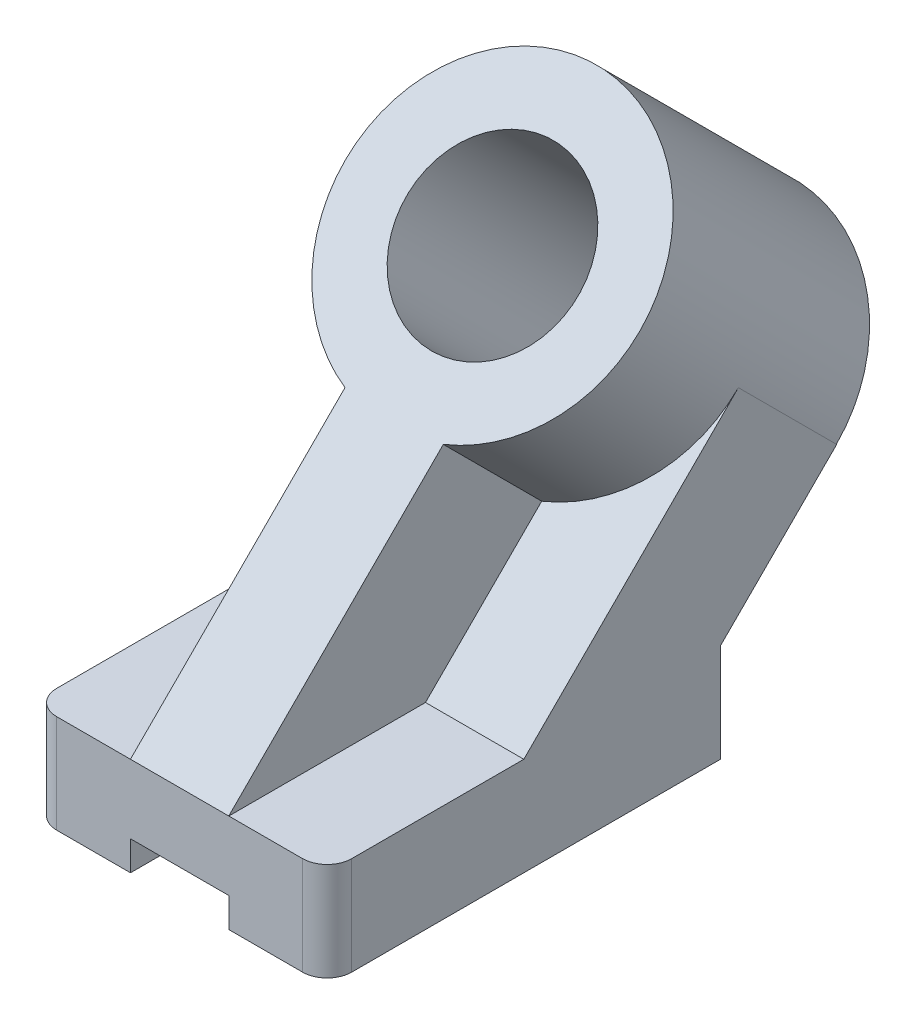
ISO-10303-21;
HEADER;
FILE_DESCRIPTION(('STEP AP214'),'2;1');
FILE_NAME('part.step','',(''),(''),'','','');
FILE_SCHEMA(('AUTOMOTIVE_DESIGN { 1 0 10303 214 1 1 1 1 }'));
ENDSEC;
DATA;
#1=APPLICATION_CONTEXT('core data for automotive mechanical design processes');
#2=APPLICATION_PROTOCOL_DEFINITION('international standard','automotive_design',2000,#1);
#3=PRODUCT_CONTEXT('',#1,'mechanical');
#4=PRODUCT('Part','Part','',(#3));
#5=PRODUCT_RELATED_PRODUCT_CATEGORY('part','',(#4));
#6=PRODUCT_DEFINITION_FORMATION('','',#4);
#7=PRODUCT_DEFINITION_CONTEXT('part definition',#1,'design');
#8=PRODUCT_DEFINITION('design','',#6,#7);
#9=PRODUCT_DEFINITION_SHAPE('','',#8);
#10=(LENGTH_UNIT() NAMED_UNIT(*) SI_UNIT(.MILLI.,.METRE.));
#11=(NAMED_UNIT(*) PLANE_ANGLE_UNIT() SI_UNIT($,.RADIAN.));
#12=(NAMED_UNIT(*) SI_UNIT($,.STERADIAN.) SOLID_ANGLE_UNIT());
#13=UNCERTAINTY_MEASURE_WITH_UNIT(LENGTH_MEASURE(1.E-05),#10,'distance_accuracy_value','');
#14=(GEOMETRIC_REPRESENTATION_CONTEXT(3) GLOBAL_UNCERTAINTY_ASSIGNED_CONTEXT((#13)) GLOBAL_UNIT_ASSIGNED_CONTEXT((#10,
#11,#12)) REPRESENTATION_CONTEXT('',''));
#15=CARTESIAN_POINT('',(0.,0.,0.));
#16=DIRECTION('',(0.,0.,1.));
#17=DIRECTION('',(1.,0.,0.));
#18=AXIS2_PLACEMENT_3D('',#15,#16,#17);
#19=CARTESIAN_POINT('',(-47.008273381295,-23.7097122302158,-101.6));
#20=DIRECTION('',(0.,-1.,0.));
#21=DIRECTION('',(0.,0.,-1.));
#22=AXIS2_PLACEMENT_3D('',#19,#20,#21);
#23=PLANE('',#22);
#24=DIRECTION('',(0.,0.,-1.));
#25=VECTOR('',#24,1.);
#26=CARTESIAN_POINT('',(-21.608273381295,-23.7097122302158,-101.6));
#27=LINE('',#26,#25);
#28=CARTESIAN_POINT('',(-21.608273381295,-23.7097122302158,0.));
#29=VERTEX_POINT('',#28);
#30=CARTESIAN_POINT('',(-21.608273381295,-23.7097122302158,-101.6));
#31=VERTEX_POINT('',#30);
#32=EDGE_CURVE('E307',#29,#31,#27,.T.);
#33=ORIENTED_EDGE('',*,*,#32,.F.);
#34=DIRECTION('',(1.,0.,0.));
#35=VECTOR('',#34,1.);
#36=CARTESIAN_POINT('',(-47.008273381295,-23.7097122302158,0.));
#37=LINE('',#36,#35);
#38=CARTESIAN_POINT('',(-40.658273381295,-23.7097122302158,0.));
#39=VERTEX_POINT('',#38);
#40=EDGE_CURVE('E365',#39,#29,#37,.T.);
#41=ORIENTED_EDGE('',*,*,#40,.F.);
#42=CARTESIAN_POINT('',(-40.658273381295,-23.7097122302158,-6.35));
#43=DIRECTION('',(0.,-1.,0.));
#44=DIRECTION('',(0.,0.,-1.));
#45=AXIS2_PLACEMENT_3D('',#42,#43,#44);
#46=CIRCLE('',#45,6.35);
#47=CARTESIAN_POINT('',(-47.008273381295,-23.7097122302158,-6.35));
#48=VERTEX_POINT('',#47);
#49=EDGE_CURVE('E247',#48,#39,#46,.F.);
#50=ORIENTED_EDGE('',*,*,#49,.F.);
#51=DIRECTION('',(0.,0.,1.));
#52=VECTOR('',#51,1.);
#53=CARTESIAN_POINT('',(-47.008273381295,-23.7097122302158,-101.6));
#54=LINE('',#53,#52);
#55=CARTESIAN_POINT('',(-47.008273381295,-23.7097122302158,-101.6));
#56=VERTEX_POINT('',#55);
#57=EDGE_CURVE('E364',#56,#48,#54,.T.);
#58=ORIENTED_EDGE('',*,*,#57,.F.);
#59=DIRECTION('',(1.,0.,0.));
#60=VECTOR('',#59,1.);
#61=CARTESIAN_POINT('',(-47.008273381295,-23.7097122302158,-101.6));
#62=LINE('',#61,#60);
#63=EDGE_CURVE('E353',#56,#31,#62,.T.);
#64=ORIENTED_EDGE('',*,*,#63,.T.);
#65=EDGE_LOOP('',(#33,#41,#50,#58,#64));
#66=FACE_BOUND('',#65,.T.);
#67=ADVANCED_FACE('F51',(#66),#23,.T.);
#68=CARTESIAN_POINT('',(29.191726618705,1.69028776978418,-101.6));
#69=DIRECTION('',(1.,0.,0.));
#70=DIRECTION('',(0.,0.,-1.));
#71=AXIS2_PLACEMENT_3D('',#68,#69,#70);
#72=PLANE('',#71);
#73=DIRECTION('',(0.,0.,1.));
#74=VECTOR('',#73,1.);
#75=CARTESIAN_POINT('',(29.191726618705,1.69028776978418,-101.6));
#76=LINE('',#75,#74);
#77=CARTESIAN_POINT('',(29.191726618705,1.69028776978418,-50.8));
#78=VERTEX_POINT('',#77);
#79=CARTESIAN_POINT('',(29.191726618705,1.69028776978418,-6.35));
#80=VERTEX_POINT('',#79);
#81=EDGE_CURVE('E377',#78,#80,#76,.T.);
#82=ORIENTED_EDGE('',*,*,#81,.T.);
#83=DIRECTION('',(0.,1.,0.));
#84=VECTOR('',#83,1.);
#85=CARTESIAN_POINT('',(29.191726618705,-49.0340344916305,-6.35));
#86=LINE('',#85,#84);
#87=CARTESIAN_POINT('',(29.191726618705,-23.7097122302158,-6.35));
#88=VERTEX_POINT('',#87);
#89=EDGE_CURVE('E236',#88,#80,#86,.T.);
#90=ORIENTED_EDGE('',*,*,#89,.F.);
#91=DIRECTION('',(0.,0.,1.));
#92=VECTOR('',#91,1.);
#93=CARTESIAN_POINT('',(29.191726618705,-23.7097122302158,-101.6));
#94=LINE('',#93,#92);
#95=CARTESIAN_POINT('',(29.191726618705,-23.7097122302158,-101.6));
#96=VERTEX_POINT('',#95);
#97=EDGE_CURVE('E381',#96,#88,#94,.T.);
#98=ORIENTED_EDGE('',*,*,#97,.F.);
#99=DIRECTION('',(0.,1.,0.));
#100=VECTOR('',#99,1.);
#101=CARTESIAN_POINT('',(29.191726618705,1.69028776978418,-101.6));
#102=LINE('',#101,#100);
#103=CARTESIAN_POINT('',(29.191726618705,1.69028776978418,-101.6));
#104=VERTEX_POINT('',#103);
#105=EDGE_CURVE('E357',#96,#104,#102,.T.);
#106=ORIENTED_EDGE('',*,*,#105,.T.);
#107=DIRECTION('',(0.,0.707106781186556,-0.707106781186539));
#108=VECTOR('',#107,1.);
#109=CARTESIAN_POINT('',(29.191726618705,1.69028776978418,-101.6));
#110=LINE('',#109,#108);
#111=CARTESIAN_POINT('',(29.191726618705,31.7125928594075,-131.622305089623));
#112=VERTEX_POINT('',#111);
#113=EDGE_CURVE('E310',#104,#112,#110,.T.);
#114=ORIENTED_EDGE('',*,*,#113,.T.);
#115=DIRECTION('',(0.,0.707106781186539,0.707106781186556));
#116=VECTOR('',#115,1.);
#117=CARTESIAN_POINT('',(29.191726618705,31.7125928594075,-131.622305089623));
#118=LINE('',#117,#116);
#119=CARTESIAN_POINT('',(29.191726618705,31.7882705979928,-131.546627351037));
#120=VERTEX_POINT('',#119);
#121=EDGE_CURVE('E330',#112,#120,#118,.T.);
#122=ORIENTED_EDGE('',*,*,#121,.T.);
#123=CARTESIAN_POINT('',(29.191726618705,57.1125928594075,-106.222305089622));
#124=VERTEX_POINT('',#123);
#125=EDGE_CURVE('E329',#120,#124,#118,.T.);
#126=ORIENTED_EDGE('',*,*,#125,.T.);
#127=DIRECTION('',(0.,-0.707106781186556,0.707106781186539));
#128=VECTOR('',#127,1.);
#129=CARTESIAN_POINT('',(29.191726618705,1.69028776978418,-50.8));
#130=LINE('',#129,#128);
#131=EDGE_CURVE('E316',#124,#78,#130,.T.);
#132=ORIENTED_EDGE('',*,*,#131,.T.);
#133=EDGE_LOOP('',(#82,#90,#98,#106,#114,#122,#126,#132));
#134=FACE_BOUND('',#133,.T.);
#135=ADVANCED_FACE('F544',(#134),#72,.T.);
#136=CARTESIAN_POINT('',(0.,0.,0.));
#137=DIRECTION('',(0.,0.,1.));
#138=DIRECTION('',(1.,0.,0.));
#139=AXIS2_PLACEMENT_3D('',#136,#137,#138);
#140=PLANE('',#139);
#141=DIRECTION('',(0.,-1.,0.));
#142=VECTOR('',#141,1.);
#143=CARTESIAN_POINT('',(-21.608273381295,-23.7097122302158,0.));
#144=LINE('',#143,#142);
#145=CARTESIAN_POINT('',(-21.608273381295,-16.0897122302158,0.));
#146=VERTEX_POINT('',#145);
#147=EDGE_CURVE('E204',#146,#29,#144,.T.);
#148=ORIENTED_EDGE('',*,*,#147,.F.);
#149=DIRECTION('',(-1.,0.,0.));
#150=VECTOR('',#149,1.);
#151=CARTESIAN_POINT('',(-21.608273381295,-16.0897122302158,0.));
#152=LINE('',#151,#150);
#153=CARTESIAN_POINT('',(3.79172661870501,-16.0897122302158,0.));
#154=VERTEX_POINT('',#153);
#155=EDGE_CURVE('E199',#154,#146,#152,.T.);
#156=ORIENTED_EDGE('',*,*,#155,.F.);
#157=DIRECTION('',(0.,1.,0.));
#158=VECTOR('',#157,1.);
#159=CARTESIAN_POINT('',(3.79172661870501,-23.7097122302158,0.));
#160=LINE('',#159,#158);
#161=CARTESIAN_POINT('',(3.79172661870501,-23.7097122302158,0.));
#162=VERTEX_POINT('',#161);
#163=EDGE_CURVE('E207',#162,#154,#160,.T.);
#164=ORIENTED_EDGE('',*,*,#163,.F.);
#165=CARTESIAN_POINT('',(22.841726618705,-23.7097122302158,0.));
#166=VERTEX_POINT('',#165);
#167=EDGE_CURVE('E341',#162,#166,#37,.T.);
#168=ORIENTED_EDGE('',*,*,#167,.T.);
#169=DIRECTION('',(0.,1.,0.));
#170=VECTOR('',#169,1.);
#171=CARTESIAN_POINT('',(22.841726618705,-49.0340344916305,0.));
#172=LINE('',#171,#170);
#173=CARTESIAN_POINT('',(22.841726618705,1.69028776978418,0.));
#174=VERTEX_POINT('',#173);
#175=EDGE_CURVE('E402',#174,#166,#172,.F.);
#176=ORIENTED_EDGE('',*,*,#175,.F.);
#177=DIRECTION('',(-1.,0.,0.));
#178=VECTOR('',#177,1.);
#179=CARTESIAN_POINT('',(-47.008273381295,1.69028776978418,0.));
#180=LINE('',#179,#178);
#181=CARTESIAN_POINT('',(3.79172661870501,1.69028776978419,0.));
#182=VERTEX_POINT('',#181);
#183=EDGE_CURVE('E352',#174,#182,#180,.T.);
#184=ORIENTED_EDGE('',*,*,#183,.T.);
#185=CARTESIAN_POINT('',(-21.608273381295,1.69028776978419,0.));
#186=VERTEX_POINT('',#185);
#187=EDGE_CURVE('E371',#182,#186,#180,.T.);
#188=ORIENTED_EDGE('',*,*,#187,.T.);
#189=CARTESIAN_POINT('',(-40.658273381295,1.69028776978418,0.));
#190=VERTEX_POINT('',#189);
#191=EDGE_CURVE('E368',#186,#190,#180,.T.);
#192=ORIENTED_EDGE('',*,*,#191,.T.);
#193=DIRECTION('',(0.,1.,0.));
#194=VECTOR('',#193,1.);
#195=CARTESIAN_POINT('',(-40.658273381295,-49.0340344916305,0.));
#196=LINE('',#195,#194);
#197=EDGE_CURVE('E60',#190,#39,#196,.F.);
#198=ORIENTED_EDGE('',*,*,#197,.T.);
#199=ORIENTED_EDGE('',*,*,#40,.T.);
#200=EDGE_LOOP('',(#148,#156,#164,#168,#176,#184,#188,#192,#198,#199));
#201=FACE_BOUND('',#200,.T.);
#202=ADVANCED_FACE('F214',(#201),#140,.T.);
#203=CARTESIAN_POINT('',(-47.008273381295,31.7125928594075,-131.622305089623));
#204=DIRECTION('',(0.,0.707106781186556,-0.707106781186539));
#205=DIRECTION('',(0.,0.707106781186539,0.707106781186556));
#206=AXIS2_PLACEMENT_3D('',#203,#204,#205);
#207=PLANE('',#206);
#208=DIRECTION('',(0.,0.707106781186539,0.707106781186556));
#209=VECTOR('',#208,1.);
#210=CARTESIAN_POINT('',(-31.133273381295,-22.0932661284215,-185.428164077453));
#211=LINE('',#210,#209);
#212=CARTESIAN_POINT('',(-31.133273381295,31.7125928594076,-131.622305089623));
#213=VERTEX_POINT('',#212);
#214=CARTESIAN_POINT('',(-31.133273381295,31.7882705979928,-131.546627351037));
#215=VERTEX_POINT('',#214);
#216=EDGE_CURVE('E257',#213,#215,#211,.T.);
#217=ORIENTED_EDGE('',*,*,#216,.F.);
#218=DIRECTION('',(1.,0.,0.));
#219=VECTOR('',#218,1.);
#220=CARTESIAN_POINT('',(-47.008273381295,31.7125928594075,-131.622305089623));
#221=LINE('',#220,#219);
#222=CARTESIAN_POINT('',(-47.008273381295,31.7125928594075,-131.622305089623));
#223=VERTEX_POINT('',#222);
#224=EDGE_CURVE('E343',#223,#213,#221,.T.);
#225=ORIENTED_EDGE('',*,*,#224,.F.);
#226=DIRECTION('',(0.,0.707106781186539,0.707106781186556));
#227=VECTOR('',#226,1.);
#228=CARTESIAN_POINT('',(-47.008273381295,31.7125928594075,-131.622305089623));
#229=LINE('',#228,#227);
#230=CARTESIAN_POINT('',(-47.008273381295,31.7882705979928,-131.546627351037));
#231=VERTEX_POINT('',#230);
#232=EDGE_CURVE('E317',#223,#231,#229,.T.);
#233=ORIENTED_EDGE('',*,*,#232,.T.);
#234=DIRECTION('',(1.,0.,0.));
#235=VECTOR('',#234,1.);
#236=CARTESIAN_POINT('',(-47.008273381295,31.7882705979928,-131.546627351037));
#237=LINE('',#236,#235);
#238=EDGE_CURVE('E388',#231,#215,#237,.T.);
#239=ORIENTED_EDGE('',*,*,#238,.T.);
#240=EDGE_LOOP('',(#217,#225,#233,#239));
#241=FACE_BOUND('',#240,.T.);
#242=ADVANCED_FACE('F568',(#241),#207,.T.);
#243=CARTESIAN_POINT('',(-47.008273381295,1.69028776978418,-101.6));
#244=DIRECTION('',(0.,1.,0.));
#245=DIRECTION('',(0.,0.,1.));
#246=AXIS2_PLACEMENT_3D('',#243,#244,#245);
#247=PLANE('',#246);
#248=CARTESIAN_POINT('',(-40.658273381295,1.69028776978418,-6.35));
#249=DIRECTION('',(0.,-1.,0.));
#250=DIRECTION('',(0.,0.,1.));
#251=AXIS2_PLACEMENT_3D('',#248,#249,#250);
#252=CIRCLE('',#251,6.35);
#253=CARTESIAN_POINT('',(-47.008273381295,1.69028776978418,-6.35));
#254=VERTEX_POINT('',#253);
#255=EDGE_CURVE('E232',#190,#254,#252,.T.);
#256=ORIENTED_EDGE('',*,*,#255,.F.);
#257=ORIENTED_EDGE('',*,*,#191,.F.);
#258=DIRECTION('',(0.,0.,1.));
#259=VECTOR('',#258,1.);
#260=CARTESIAN_POINT('',(-21.608273381295,1.69028776978418,-101.6));
#261=LINE('',#260,#259);
#262=CARTESIAN_POINT('',(-21.608273381295,1.69028776978418,-50.8));
#263=VERTEX_POINT('',#262);
#264=EDGE_CURVE('E304',#263,#186,#261,.T.);
#265=ORIENTED_EDGE('',*,*,#264,.F.);
#266=DIRECTION('',(1.,0.,0.));
#267=VECTOR('',#266,1.);
#268=CARTESIAN_POINT('',(-47.008273381295,1.69028776978418,-50.8));
#269=LINE('',#268,#267);
#270=CARTESIAN_POINT('',(-47.008273381295,1.69028776978418,-50.8));
#271=VERTEX_POINT('',#270);
#272=EDGE_CURVE('E337',#271,#263,#269,.T.);
#273=ORIENTED_EDGE('',*,*,#272,.F.);
#274=DIRECTION('',(0.,0.,1.));
#275=VECTOR('',#274,1.);
#276=CARTESIAN_POINT('',(-47.008273381295,1.69028776978418,-101.6));
#277=LINE('',#276,#275);
#278=EDGE_CURVE('E372',#271,#254,#277,.T.);
#279=ORIENTED_EDGE('',*,*,#278,.T.);
#280=EDGE_LOOP('',(#256,#257,#265,#273,#279));
#281=FACE_BOUND('',#280,.T.);
#282=ADVANCED_FACE('F501',(#281),#247,.T.);
#283=CARTESIAN_POINT('',(-47.008273381295,1.69028776978418,-50.8));
#284=DIRECTION('',(0.,0.707106781186539,0.707106781186556));
#285=DIRECTION('',(0.,-0.707106781186556,0.707106781186539));
#286=AXIS2_PLACEMENT_3D('',#283,#284,#285);
#287=PLANE('',#286);
#288=DIRECTION('',(0.,-0.707106781186556,0.707106781186539));
#289=VECTOR('',#288,1.);
#290=CARTESIAN_POINT('',(-21.608273381295,1.69028776978418,-50.8));
#291=LINE('',#290,#289);
#292=CARTESIAN_POINT('',(-21.608273381295,31.7125928594072,-80.8223050896223));
#293=VERTEX_POINT('',#292);
#294=EDGE_CURVE('E395',#293,#263,#291,.T.);
#295=ORIENTED_EDGE('',*,*,#294,.F.);
#296=CARTESIAN_POINT('',(-8.908273381295,57.1125928594075,-106.222305089622));
#297=DIRECTION('',(0.,0.707106781186539,0.707106781186556));
#298=DIRECTION('',(0.,-0.707106781186556,0.707106781186539));
#299=AXIS2_PLACEMENT_3D('',#296,#297,#298);
#300=CIRCLE('',#299,38.1);
#301=CARTESIAN_POINT('',(-47.008273381295,57.1125928594075,-106.222305089622));
#302=VERTEX_POINT('',#301);
#303=EDGE_CURVE('E298',#302,#293,#300,.T.);
#304=ORIENTED_EDGE('',*,*,#303,.F.);
#305=DIRECTION('',(0.,-0.707106781186556,0.707106781186539));
#306=VECTOR('',#305,1.);
#307=CARTESIAN_POINT('',(-47.008273381295,1.69028776978418,-50.8));
#308=LINE('',#307,#306);
#309=EDGE_CURVE('E321',#302,#271,#308,.T.);
#310=ORIENTED_EDGE('',*,*,#309,.T.);
#311=ORIENTED_EDGE('',*,*,#272,.T.);
#312=EDGE_LOOP('',(#295,#304,#310,#311));
#313=FACE_BOUND('',#312,.T.);
#314=ADVANCED_FACE('F498',(#313),#287,.T.);
#315=DIRECTION('',(0.,0.707106781186539,0.707106781186556));
#316=VECTOR('',#315,1.);
#317=CARTESIAN_POINT('',(13.316726618705,-22.0932661284215,-185.428164077453));
#318=LINE('',#317,#316);
#319=CARTESIAN_POINT('',(13.316726618705,31.7882705979928,-131.546627351037));
#320=VERTEX_POINT('',#319);
#321=CARTESIAN_POINT('',(13.316726618705,31.7125928594076,-131.622305089623));
#322=VERTEX_POINT('',#321);
#323=EDGE_CURVE('E254',#320,#322,#318,.F.);
#324=ORIENTED_EDGE('',*,*,#323,.F.);
#325=EDGE_CURVE('E376',#320,#120,#237,.T.);
#326=ORIENTED_EDGE('',*,*,#325,.T.);
#327=ORIENTED_EDGE('',*,*,#121,.F.);
#328=EDGE_CURVE('E325',#322,#112,#221,.T.);
#329=ORIENTED_EDGE('',*,*,#328,.F.);
#330=EDGE_LOOP('',(#324,#326,#327,#329));
#331=FACE_BOUND('',#330,.T.);
#332=ADVANCED_FACE('F574',(#331),#207,.T.);
#333=CARTESIAN_POINT('',(-47.008273381295,1.69028776978418,-101.6));
#334=DIRECTION('',(-1.,0.,0.));
#335=DIRECTION('',(0.,0.,1.));
#336=AXIS2_PLACEMENT_3D('',#333,#334,#335);
#337=PLANE('',#336);
#338=DIRECTION('',(0.,1.,0.));
#339=VECTOR('',#338,1.);
#340=CARTESIAN_POINT('',(-47.008273381295,-49.0340344916305,-6.35));
#341=LINE('',#340,#339);
#342=EDGE_CURVE('E235',#48,#254,#341,.T.);
#343=ORIENTED_EDGE('',*,*,#342,.T.);
#344=ORIENTED_EDGE('',*,*,#278,.F.);
#345=ORIENTED_EDGE('',*,*,#309,.F.);
#346=EDGE_CURVE('E315',#231,#302,#229,.T.);
#347=ORIENTED_EDGE('',*,*,#346,.F.);
#348=ORIENTED_EDGE('',*,*,#232,.F.);
#349=DIRECTION('',(0.,0.707106781186556,-0.707106781186539));
#350=VECTOR('',#349,1.);
#351=CARTESIAN_POINT('',(-47.008273381295,1.69028776978418,-101.6));
#352=LINE('',#351,#350);
#353=CARTESIAN_POINT('',(-47.008273381295,1.69028776978418,-101.6));
#354=VERTEX_POINT('',#353);
#355=EDGE_CURVE('E311',#354,#223,#352,.T.);
#356=ORIENTED_EDGE('',*,*,#355,.F.);
#357=DIRECTION('',(0.,-1.,0.));
#358=VECTOR('',#357,1.);
#359=CARTESIAN_POINT('',(-47.008273381295,1.69028776978418,-101.6));
#360=LINE('',#359,#358);
#361=EDGE_CURVE('E347',#354,#56,#360,.T.);
#362=ORIENTED_EDGE('',*,*,#361,.T.);
#363=ORIENTED_EDGE('',*,*,#57,.T.);
#364=EDGE_LOOP('',(#343,#344,#345,#347,#348,#356,#362,#363));
#365=FACE_BOUND('',#364,.T.);
#366=ADVANCED_FACE('F53',(#365),#337,.T.);
#367=CARTESIAN_POINT('',(22.841726618705,1.69028776978418,-6.35));
#368=DIRECTION('',(0.,-1.,0.));
#369=DIRECTION('',(0.,0.,-1.));
#370=AXIS2_PLACEMENT_3D('',#367,#368,#369);
#371=CIRCLE('',#370,6.35);
#372=EDGE_CURVE('E75',#80,#174,#371,.T.);
#373=ORIENTED_EDGE('',*,*,#372,.F.);
#374=ORIENTED_EDGE('',*,*,#81,.F.);
#375=CARTESIAN_POINT('',(3.79172661870501,1.69028776978418,-50.8));
#376=VERTEX_POINT('',#375);
#377=EDGE_CURVE('E342',#376,#78,#269,.T.);
#378=ORIENTED_EDGE('',*,*,#377,.F.);
#379=DIRECTION('',(0.,0.,-1.));
#380=VECTOR('',#379,1.);
#381=CARTESIAN_POINT('',(3.79172661870501,1.69028776978418,-101.6));
#382=LINE('',#381,#380);
#383=EDGE_CURVE('E299',#182,#376,#382,.T.);
#384=ORIENTED_EDGE('',*,*,#383,.F.);
#385=ORIENTED_EDGE('',*,*,#183,.F.);
#386=EDGE_LOOP('',(#373,#374,#378,#384,#385));
#387=FACE_BOUND('',#386,.T.);
#388=ADVANCED_FACE('F518',(#387),#247,.T.);
#389=DIRECTION('',(0.,0.,1.));
#390=VECTOR('',#389,1.);
#391=CARTESIAN_POINT('',(3.79172661870501,-23.7097122302158,-101.6));
#392=LINE('',#391,#390);
#393=CARTESIAN_POINT('',(3.79172661870501,-23.7097122302158,-101.6));
#394=VERTEX_POINT('',#393);
#395=EDGE_CURVE('E209',#394,#162,#392,.T.);
#396=ORIENTED_EDGE('',*,*,#395,.F.);
#397=EDGE_CURVE('E351',#394,#96,#62,.T.);
#398=ORIENTED_EDGE('',*,*,#397,.T.);
#399=ORIENTED_EDGE('',*,*,#97,.T.);
#400=CARTESIAN_POINT('',(22.841726618705,-23.7097122302158,-6.35));
#401=DIRECTION('',(0.,-1.,0.));
#402=DIRECTION('',(0.,0.,-1.));
#403=AXIS2_PLACEMENT_3D('',#400,#401,#402);
#404=CIRCLE('',#403,6.35);
#405=EDGE_CURVE('E240',#166,#88,#404,.F.);
#406=ORIENTED_EDGE('',*,*,#405,.F.);
#407=ORIENTED_EDGE('',*,*,#167,.F.);
#408=EDGE_LOOP('',(#396,#398,#399,#406,#407));
#409=FACE_BOUND('',#408,.T.);
#410=ADVANCED_FACE('F545',(#409),#23,.T.);
#411=CARTESIAN_POINT('',(0.,0.,-101.6));
#412=DIRECTION('',(0.,0.,1.));
#413=DIRECTION('',(1.,0.,0.));
#414=AXIS2_PLACEMENT_3D('',#411,#412,#413);
#415=PLANE('',#414);
#416=DIRECTION('',(-1.,0.,0.));
#417=VECTOR('',#416,1.);
#418=CARTESIAN_POINT('',(0.,-16.0897122302158,-101.6));
#419=LINE('',#418,#417);
#420=CARTESIAN_POINT('',(3.79172661870501,-16.0897122302158,-101.6));
#421=VERTEX_POINT('',#420);
#422=CARTESIAN_POINT('',(-21.608273381295,-16.0897122302158,-101.6));
#423=VERTEX_POINT('',#422);
#424=EDGE_CURVE('E13',#421,#423,#419,.T.);
#425=ORIENTED_EDGE('',*,*,#424,.T.);
#426=DIRECTION('',(0.,-1.,0.));
#427=VECTOR('',#426,1.);
#428=CARTESIAN_POINT('',(-21.608273381295,0.,-101.6));
#429=LINE('',#428,#427);
#430=EDGE_CURVE('E228',#423,#31,#429,.T.);
#431=ORIENTED_EDGE('',*,*,#430,.T.);
#432=ORIENTED_EDGE('',*,*,#63,.F.);
#433=ORIENTED_EDGE('',*,*,#361,.F.);
#434=DIRECTION('',(-1.,0.,0.));
#435=VECTOR('',#434,1.);
#436=CARTESIAN_POINT('',(-47.008273381295,1.69028776978418,-101.6));
#437=LINE('',#436,#435);
#438=EDGE_CURVE('E360',#104,#354,#437,.T.);
#439=ORIENTED_EDGE('',*,*,#438,.F.);
#440=ORIENTED_EDGE('',*,*,#105,.F.);
#441=ORIENTED_EDGE('',*,*,#397,.F.);
#442=DIRECTION('',(0.,1.,0.));
#443=VECTOR('',#442,1.);
#444=CARTESIAN_POINT('',(3.79172661870501,0.,-101.6));
#445=LINE('',#444,#443);
#446=EDGE_CURVE('E224',#394,#421,#445,.T.);
#447=ORIENTED_EDGE('',*,*,#446,.T.);
#448=EDGE_LOOP('',(#425,#431,#432,#433,#439,#440,#441,#447));
#449=FACE_BOUND('',#448,.T.);
#450=ADVANCED_FACE('F419',(#449),#415,.F.);
#451=CARTESIAN_POINT('',(3.79172661870501,31.7125928594073,-80.8223050896224));
#452=VERTEX_POINT('',#451);
#453=EDGE_CURVE('E287',#452,#124,#300,.T.);
#454=ORIENTED_EDGE('',*,*,#453,.F.);
#455=DIRECTION('',(0.,0.707106781186556,-0.707106781186539));
#456=VECTOR('',#455,1.);
#457=CARTESIAN_POINT('',(3.79172661870501,1.69028776978418,-50.8));
#458=LINE('',#457,#456);
#459=EDGE_CURVE('E392',#376,#452,#458,.T.);
#460=ORIENTED_EDGE('',*,*,#459,.F.);
#461=ORIENTED_EDGE('',*,*,#377,.T.);
#462=ORIENTED_EDGE('',*,*,#131,.F.);
#463=EDGE_LOOP('',(#454,#460,#461,#462));
#464=FACE_BOUND('',#463,.T.);
#465=ADVANCED_FACE('F523',(#464),#287,.T.);
#466=CARTESIAN_POINT('',(-47.008273381295,1.69028776978418,-101.6));
#467=DIRECTION('',(0.,-0.707106781186539,-0.707106781186556));
#468=DIRECTION('',(0.,0.707106781186556,-0.707106781186539));
#469=AXIS2_PLACEMENT_3D('',#466,#467,#468);
#470=PLANE('',#469);
#471=CARTESIAN_POINT('',(-8.908273381295,31.7125928594075,-131.622305089623));
#472=DIRECTION('',(0.,-0.707106781186539,-0.707106781186556));
#473=DIRECTION('',(0.,0.707106781186556,-0.707106781186539));
#474=AXIS2_PLACEMENT_3D('',#471,#472,#473);
#475=CIRCLE('',#474,22.225);
#476=EDGE_CURVE('E260',#322,#213,#475,.T.);
#477=ORIENTED_EDGE('',*,*,#476,.F.);
#478=ORIENTED_EDGE('',*,*,#328,.T.);
#479=ORIENTED_EDGE('',*,*,#113,.F.);
#480=ORIENTED_EDGE('',*,*,#438,.T.);
#481=ORIENTED_EDGE('',*,*,#355,.T.);
#482=ORIENTED_EDGE('',*,*,#224,.T.);
#483=EDGE_LOOP('',(#477,#478,#479,#480,#481,#482));
#484=FACE_BOUND('',#483,.T.);
#485=ADVANCED_FACE('F530',(#484),#470,.T.);
#486=CARTESIAN_POINT('',(-8.908273381295,82.5267176820329,-80.8081802669961));
#487=DIRECTION('',(0.,0.707106781186539,0.707106781186556));
#488=DIRECTION('',(0.,-0.707106781186556,0.707106781186539));
#489=AXIS2_PLACEMENT_3D('',#486,#487,#488);
#490=PLANE('',#489);
#491=CARTESIAN_POINT('',(-8.908273381295,82.5267176820329,-80.8081802669961));
#492=DIRECTION('',(0.,0.707106781186539,0.707106781186556));
#493=DIRECTION('',(0.,-0.707106781186556,0.707106781186539));
#494=AXIS2_PLACEMENT_3D('',#491,#492,#493);
#495=CIRCLE('',#494,22.225);
#496=CARTESIAN_POINT('',(-8.908273381295,66.8112694701617,-65.0927320551253));
#497=VERTEX_POINT('',#496);
#498=EDGE_CURVE('E250',#497,#497,#495,.T.);
#499=ORIENTED_EDGE('',*,*,#498,.F.);
#500=EDGE_LOOP('',(#499));
#501=FACE_BOUND('',#500,.T.);
#502=DIRECTION('',(0.,-0.707106781186556,0.707106781186539));
#503=VECTOR('',#502,1.);
#504=CARTESIAN_POINT('',(-21.608273381295,1.70441259240958,0.0141248226253922));
#505=LINE('',#504,#503);
#506=CARTESIAN_POINT('',(-21.608273381295,57.1267176820326,-55.4081802669964));
#507=VERTEX_POINT('',#506);
#508=CARTESIAN_POINT('',(-21.608273381295,1.70441259240958,0.0141248226253922));
#509=VERTEX_POINT('',#508);
#510=EDGE_CURVE('E263',#507,#509,#505,.T.);
#511=ORIENTED_EDGE('',*,*,#510,.T.);
#512=DIRECTION('',(1.,0.,0.));
#513=VECTOR('',#512,1.);
#514=CARTESIAN_POINT('',(-21.608273381295,1.70441259240958,0.0141248226253922));
#515=LINE('',#514,#513);
#516=CARTESIAN_POINT('',(3.79172661870501,1.70441259240958,0.0141248226253887));
#517=VERTEX_POINT('',#516);
#518=EDGE_CURVE('E267',#509,#517,#515,.T.);
#519=ORIENTED_EDGE('',*,*,#518,.T.);
#520=DIRECTION('',(0.,0.707106781186556,-0.707106781186539));
#521=VECTOR('',#520,1.);
#522=CARTESIAN_POINT('',(3.79172661870501,1.70441259240958,0.0141248226253887));
#523=LINE('',#522,#521);
#524=CARTESIAN_POINT('',(3.79172661870501,57.1267176820326,-55.4081802669964));
#525=VERTEX_POINT('',#524);
#526=EDGE_CURVE('E271',#517,#525,#523,.T.);
#527=ORIENTED_EDGE('',*,*,#526,.T.);
#528=CARTESIAN_POINT('',(-8.908273381295,82.5267176820329,-80.8081802669961));
#529=DIRECTION('',(0.,0.707106781186539,0.707106781186556));
#530=DIRECTION('',(0.,-0.707106781186556,0.707106781186539));
#531=AXIS2_PLACEMENT_3D('',#528,#529,#530);
#532=CIRCLE('',#531,38.1);
#533=EDGE_CURVE('E275',#525,#507,#532,.T.);
#534=ORIENTED_EDGE('',*,*,#533,.T.);
#535=EDGE_LOOP('',(#511,#519,#527,#534));
#536=FACE_BOUND('',#535,.T.);
#537=ADVANCED_FACE('F527',(#501,#536),#490,.T.);
#538=CARTESIAN_POINT('',(-8.908273381295,31.7882705979928,-131.546627351037));
#539=DIRECTION('',(0.,0.707106781186539,0.707106781186556));
#540=DIRECTION('',(0.,-0.707106781186556,0.707106781186539));
#541=AXIS2_PLACEMENT_3D('',#538,#539,#540);
#542=PLANE('',#541);
#543=ORIENTED_EDGE('',*,*,#325,.F.);
#544=CARTESIAN_POINT('',(-8.908273381295,31.7882705979928,-131.546627351037));
#545=DIRECTION('',(0.,0.707106781186539,0.707106781186556));
#546=DIRECTION('',(0.,-0.707106781186556,0.707106781186539));
#547=AXIS2_PLACEMENT_3D('',#544,#545,#546);
#548=CIRCLE('',#547,22.225);
#549=EDGE_CURVE('E398',#320,#215,#548,.T.);
#550=ORIENTED_EDGE('',*,*,#549,.T.);
#551=ORIENTED_EDGE('',*,*,#238,.F.);
#552=CARTESIAN_POINT('',(-8.908273381295,31.7882705979928,-131.546627351037));
#553=DIRECTION('',(0.,0.707106781186539,0.707106781186556));
#554=DIRECTION('',(0.,-0.707106781186556,0.707106781186539));
#555=AXIS2_PLACEMENT_3D('',#552,#553,#554);
#556=CIRCLE('',#555,38.1);
#557=EDGE_CURVE('E279',#120,#231,#556,.T.);
#558=ORIENTED_EDGE('',*,*,#557,.F.);
#559=EDGE_LOOP('',(#543,#550,#551,#558));
#560=FACE_BOUND('',#559,.T.);
#561=ADVANCED_FACE('F529',(#560),#542,.F.);
#562=CARTESIAN_POINT('',(-21.608273381295,-49.0340344916305,-50.7243222614159));
#563=DIRECTION('',(0.,-0.707106781186556,0.707106781186539));
#564=DIRECTION('',(0.,-0.707106781186539,-0.707106781186556));
#565=AXIS2_PLACEMENT_3D('',#562,#563,#564);
#566=PLANE('',#565);
#567=DIRECTION('',(0.,0.707106781186539,0.707106781186556));
#568=VECTOR('',#567,1.);
#569=CARTESIAN_POINT('',(-21.608273381295,-49.0340344916305,-50.7243222614159));
#570=LINE('',#569,#568);
#571=EDGE_CURVE('E283',#186,#509,#570,.T.);
#572=ORIENTED_EDGE('',*,*,#571,.F.);
#573=ORIENTED_EDGE('',*,*,#187,.F.);
#574=DIRECTION('',(0.,0.707106781186539,0.707106781186556));
#575=VECTOR('',#574,1.);
#576=CARTESIAN_POINT('',(3.79172661870501,-49.0340344916305,-50.7243222614159));
#577=LINE('',#576,#575);
#578=EDGE_CURVE('E291',#182,#517,#577,.T.);
#579=ORIENTED_EDGE('',*,*,#578,.T.);
#580=ORIENTED_EDGE('',*,*,#518,.F.);
#581=EDGE_LOOP('',(#572,#573,#579,#580));
#582=FACE_BOUND('',#581,.T.);
#583=ADVANCED_FACE('F509',(#582),#566,.T.);
#584=CARTESIAN_POINT('',(3.79172661870501,-49.0340344916305,-50.7243222614159));
#585=DIRECTION('',(1.,0.,0.));
#586=DIRECTION('',(0.,1.,0.));
#587=AXIS2_PLACEMENT_3D('',#584,#585,#586);
#588=PLANE('',#587);
#589=ORIENTED_EDGE('',*,*,#578,.F.);
#590=ORIENTED_EDGE('',*,*,#383,.T.);
#591=ORIENTED_EDGE('',*,*,#459,.T.);
#592=DIRECTION('',(0.,0.707106781186539,0.707106781186556));
#593=VECTOR('',#592,1.);
#594=CARTESIAN_POINT('',(3.79172661870501,6.38827059799252,-106.146627351038));
#595=LINE('',#594,#593);
#596=EDGE_CURVE('E288',#452,#525,#595,.T.);
#597=ORIENTED_EDGE('',*,*,#596,.T.);
#598=ORIENTED_EDGE('',*,*,#526,.F.);
#599=EDGE_LOOP('',(#589,#590,#591,#597,#598));
#600=FACE_BOUND('',#599,.T.);
#601=ADVANCED_FACE('F514',(#600),#588,.T.);
#602=CARTESIAN_POINT('',(-8.908273381295,31.7882705979928,-131.546627351037));
#603=DIRECTION('',(0.,0.707106781186539,0.707106781186556));
#604=DIRECTION('',(0.,-0.707106781186556,0.707106781186539));
#605=AXIS2_PLACEMENT_3D('',#602,#603,#604);
#606=CYLINDRICAL_SURFACE('',#605,38.1);
#607=ORIENTED_EDGE('',*,*,#346,.T.);
#608=ORIENTED_EDGE('',*,*,#303,.T.);
#609=DIRECTION('',(0.,0.707106781186539,0.707106781186556));
#610=VECTOR('',#609,1.);
#611=CARTESIAN_POINT('',(-21.608273381295,6.38827059799251,-106.146627351038));
#612=LINE('',#611,#610);
#613=EDGE_CURVE('E284',#293,#507,#612,.T.);
#614=ORIENTED_EDGE('',*,*,#613,.T.);
#615=ORIENTED_EDGE('',*,*,#533,.F.);
#616=ORIENTED_EDGE('',*,*,#596,.F.);
#617=ORIENTED_EDGE('',*,*,#453,.T.);
#618=ORIENTED_EDGE('',*,*,#125,.F.);
#619=ORIENTED_EDGE('',*,*,#557,.T.);
#620=EDGE_LOOP('',(#607,#608,#614,#615,#616,#617,#618,#619));
#621=FACE_BOUND('',#620,.T.);
#622=ADVANCED_FACE('F488',(#621),#606,.T.);
#623=CARTESIAN_POINT('',(-21.608273381295,-49.0340344916305,-50.7243222614159));
#624=DIRECTION('',(-1.,0.,0.));
#625=DIRECTION('',(0.,0.,1.));
#626=AXIS2_PLACEMENT_3D('',#623,#624,#625);
#627=PLANE('',#626);
#628=ORIENTED_EDGE('',*,*,#294,.T.);
#629=ORIENTED_EDGE('',*,*,#264,.T.);
#630=ORIENTED_EDGE('',*,*,#571,.T.);
#631=ORIENTED_EDGE('',*,*,#510,.F.);
#632=ORIENTED_EDGE('',*,*,#613,.F.);
#633=EDGE_LOOP('',(#628,#629,#630,#631,#632));
#634=FACE_BOUND('',#633,.T.);
#635=ADVANCED_FACE('F496',(#634),#627,.T.);
#636=CARTESIAN_POINT('',(-8.908273381295,-22.0932661284215,-185.428164077453));
#637=DIRECTION('',(0.,0.707106781186539,0.707106781186556));
#638=DIRECTION('',(0.,-0.707106781186556,0.707106781186539));
#639=AXIS2_PLACEMENT_3D('',#636,#637,#638);
#640=CYLINDRICAL_SURFACE('',#639,22.225);
#641=ORIENTED_EDGE('',*,*,#476,.T.);
#642=ORIENTED_EDGE('',*,*,#216,.T.);
#643=ORIENTED_EDGE('',*,*,#549,.F.);
#644=ORIENTED_EDGE('',*,*,#323,.T.);
#645=EDGE_LOOP('',(#641,#642,#643,#644));
#646=FACE_BOUND('',#645,.T.);
#647=ORIENTED_EDGE('',*,*,#498,.T.);
#648=EDGE_LOOP('',(#647));
#649=FACE_BOUND('',#648,.T.);
#650=ADVANCED_FACE('F589',(#646,#649),#640,.F.);
#651=CARTESIAN_POINT('',(22.841726618705,-49.0340344916305,-6.35));
#652=DIRECTION('',(0.,1.,0.));
#653=DIRECTION('',(0.,0.,1.));
#654=AXIS2_PLACEMENT_3D('',#651,#652,#653);
#655=CYLINDRICAL_SURFACE('',#654,6.35);
#656=ORIENTED_EDGE('',*,*,#405,.T.);
#657=ORIENTED_EDGE('',*,*,#89,.T.);
#658=ORIENTED_EDGE('',*,*,#372,.T.);
#659=ORIENTED_EDGE('',*,*,#175,.T.);
#660=EDGE_LOOP('',(#656,#657,#658,#659));
#661=FACE_BOUND('',#660,.T.);
#662=ADVANCED_FACE('F559',(#661),#655,.T.);
#663=CARTESIAN_POINT('',(-40.658273381295,-49.0340344916305,-6.35));
#664=DIRECTION('',(0.,1.,0.));
#665=DIRECTION('',(0.,0.,1.));
#666=AXIS2_PLACEMENT_3D('',#663,#664,#665);
#667=CYLINDRICAL_SURFACE('',#666,6.35);
#668=ORIENTED_EDGE('',*,*,#49,.T.);
#669=ORIENTED_EDGE('',*,*,#197,.F.);
#670=ORIENTED_EDGE('',*,*,#255,.T.);
#671=ORIENTED_EDGE('',*,*,#342,.F.);
#672=EDGE_LOOP('',(#668,#669,#670,#671));
#673=FACE_BOUND('',#672,.T.);
#674=ADVANCED_FACE('F503',(#673),#667,.T.);
#675=CARTESIAN_POINT('',(-21.608273381295,-16.0897122302158,-158.487395714245));
#676=DIRECTION('',(0.,1.,0.));
#677=DIRECTION('',(-1.,0.,0.));
#678=AXIS2_PLACEMENT_3D('',#675,#676,#677);
#679=PLANE('',#678);
#680=DIRECTION('',(0.,0.,1.));
#681=VECTOR('',#680,1.);
#682=CARTESIAN_POINT('',(3.79172661870501,-16.0897122302158,-158.487395714245));
#683=LINE('',#682,#681);
#684=EDGE_CURVE('E67',#421,#154,#683,.T.);
#685=ORIENTED_EDGE('',*,*,#684,.T.);
#686=ORIENTED_EDGE('',*,*,#155,.T.);
#687=DIRECTION('',(0.,0.,1.));
#688=VECTOR('',#687,1.);
#689=CARTESIAN_POINT('',(-21.608273381295,-16.0897122302158,-158.487395714245));
#690=LINE('',#689,#688);
#691=EDGE_CURVE('E203',#423,#146,#690,.T.);
#692=ORIENTED_EDGE('',*,*,#691,.F.);
#693=ORIENTED_EDGE('',*,*,#424,.F.);
#694=EDGE_LOOP('',(#685,#686,#692,#693));
#695=FACE_BOUND('',#694,.T.);
#696=ADVANCED_FACE('F196',(#695),#679,.F.);
#697=CARTESIAN_POINT('',(-21.608273381295,-23.7097122302158,-158.487395714245));
#698=DIRECTION('',(-1.,0.,0.));
#699=DIRECTION('',(0.,0.,1.));
#700=AXIS2_PLACEMENT_3D('',#697,#698,#699);
#701=PLANE('',#700);
#702=ORIENTED_EDGE('',*,*,#147,.T.);
#703=ORIENTED_EDGE('',*,*,#32,.T.);
#704=ORIENTED_EDGE('',*,*,#430,.F.);
#705=ORIENTED_EDGE('',*,*,#691,.T.);
#706=EDGE_LOOP('',(#702,#703,#704,#705));
#707=FACE_BOUND('',#706,.T.);
#708=ADVANCED_FACE('F417',(#707),#701,.F.);
#709=CARTESIAN_POINT('',(3.79172661870501,-23.7097122302158,-158.487395714245));
#710=DIRECTION('',(1.,0.,0.));
#711=DIRECTION('',(0.,0.,-1.));
#712=AXIS2_PLACEMENT_3D('',#709,#710,#711);
#713=PLANE('',#712);
#714=ORIENTED_EDGE('',*,*,#446,.F.);
#715=ORIENTED_EDGE('',*,*,#395,.T.);
#716=ORIENTED_EDGE('',*,*,#163,.T.);
#717=ORIENTED_EDGE('',*,*,#684,.F.);
#718=EDGE_LOOP('',(#714,#715,#716,#717));
#719=FACE_BOUND('',#718,.T.);
#720=ADVANCED_FACE('F208',(#719),#713,.F.);
#721=CLOSED_SHELL('',(#67,#135,#202,#242,#282,#314,#332,#366,#388,#410,#450,#465,#485,#537,#561,
#583,#601,#622,#635,#650,#662,#674,#696,#708,#720));
#722=MANIFOLD_SOLID_BREP('B2',#721);
#723=ADVANCED_BREP_SHAPE_REPRESENTATION('',(#18,#722),#14);
#724=SHAPE_DEFINITION_REPRESENTATION(#9,#723);
ENDSEC;
END-ISO-10303-21;
